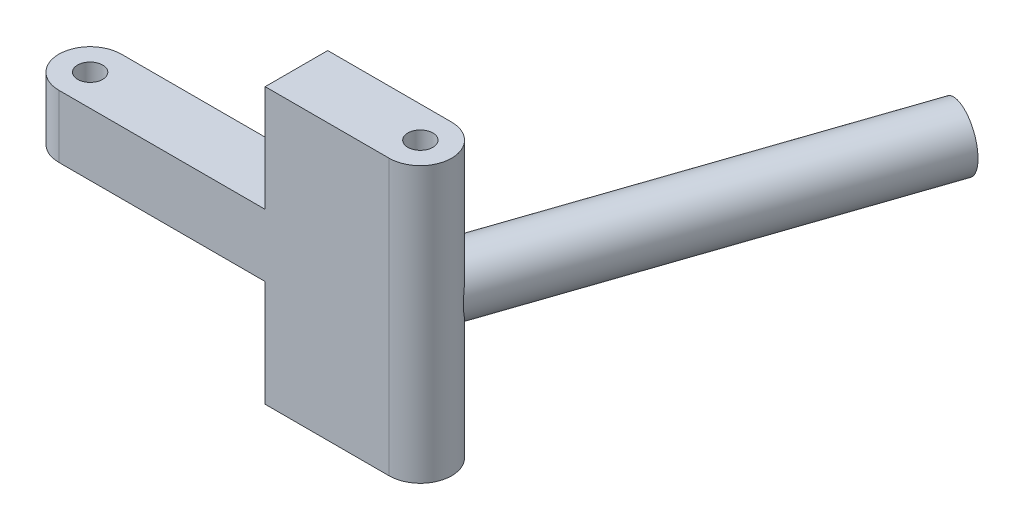
ISO-10303-21;
HEADER;
FILE_DESCRIPTION(('STEP AP214'),'2;1');
FILE_NAME('part.step','',(''),(''),'','','');
FILE_SCHEMA(('AUTOMOTIVE_DESIGN { 1 0 10303 214 1 1 1 1 }'));
ENDSEC;
DATA;
#1=APPLICATION_CONTEXT('core data for automotive mechanical design processes');
#2=APPLICATION_PROTOCOL_DEFINITION('international standard','automotive_design',2000,#1);
#3=PRODUCT_CONTEXT('',#1,'mechanical');
#4=PRODUCT('Part','Part','',(#3));
#5=PRODUCT_RELATED_PRODUCT_CATEGORY('part','',(#4));
#6=PRODUCT_DEFINITION_FORMATION('','',#4);
#7=PRODUCT_DEFINITION_CONTEXT('part definition',#1,'design');
#8=PRODUCT_DEFINITION('design','',#6,#7);
#9=PRODUCT_DEFINITION_SHAPE('','',#8);
#10=(LENGTH_UNIT() NAMED_UNIT(*) SI_UNIT(.MILLI.,.METRE.));
#11=(NAMED_UNIT(*) PLANE_ANGLE_UNIT() SI_UNIT($,.RADIAN.));
#12=(NAMED_UNIT(*) SI_UNIT($,.STERADIAN.) SOLID_ANGLE_UNIT());
#13=UNCERTAINTY_MEASURE_WITH_UNIT(LENGTH_MEASURE(1.E-05),#10,'distance_accuracy_value','');
#14=(GEOMETRIC_REPRESENTATION_CONTEXT(3) GLOBAL_UNCERTAINTY_ASSIGNED_CONTEXT((#13)) GLOBAL_UNIT_ASSIGNED_CONTEXT((#10,
#11,#12)) REPRESENTATION_CONTEXT('',''));
#15=CARTESIAN_POINT('',(0.,0.,0.));
#16=DIRECTION('',(0.,0.,1.));
#17=DIRECTION('',(1.,0.,0.));
#18=AXIS2_PLACEMENT_3D('',#15,#16,#17);
#19=CARTESIAN_POINT('',(0.,22.,-2.5));
#20=DIRECTION('',(0.,0.,1.));
#21=DIRECTION('',(1.,0.,0.));
#22=AXIS2_PLACEMENT_3D('',#19,#20,#21);
#23=PLANE('',#22);
#24=CARTESIAN_POINT('',(26.4099999999985,11.,-2.49999999994088));
#25=DIRECTION('',(0.,0.,1.));
#26=DIRECTION('',(1.,0.,0.));
#27=AXIS2_PLACEMENT_3D('',#24,#25,#26);
#28=ELLIPSE('',#27,2.53480640832575,2.4);
#29=CARTESIAN_POINT('',(26.41,8.6,-2.5));
#30=VERTEX_POINT('',#29);
#31=CARTESIAN_POINT('',(26.41,13.4,-2.5));
#32=VERTEX_POINT('',#31);
#33=EDGE_CURVE('E120',#30,#32,#28,.F.);
#34=ORIENTED_EDGE('',*,*,#33,.F.);
#35=DIRECTION('',(0.,-1.,0.));
#36=VECTOR('',#35,1.);
#37=CARTESIAN_POINT('',(26.41,22.,-2.5));
#38=LINE('',#37,#36);
#39=CARTESIAN_POINT('',(26.41,0.,-2.5));
#40=VERTEX_POINT('',#39);
#41=EDGE_CURVE('E107',#30,#40,#38,.T.);
#42=ORIENTED_EDGE('',*,*,#41,.T.);
#43=DIRECTION('',(-1.,0.,0.));
#44=VECTOR('',#43,1.);
#45=CARTESIAN_POINT('',(0.,0.,-2.5));
#46=LINE('',#45,#44);
#47=CARTESIAN_POINT('',(16.5,0.,-2.5));
#48=VERTEX_POINT('',#47);
#49=EDGE_CURVE('E210',#40,#48,#46,.T.);
#50=ORIENTED_EDGE('',*,*,#49,.T.);
#51=DIRECTION('',(0.,1.,0.));
#52=VECTOR('',#51,1.);
#53=CARTESIAN_POINT('',(16.5,0.,-2.5));
#54=LINE('',#53,#52);
#55=CARTESIAN_POINT('',(16.5,8.5,-2.5));
#56=VERTEX_POINT('',#55);
#57=EDGE_CURVE('E59',#48,#56,#54,.T.);
#58=ORIENTED_EDGE('',*,*,#57,.T.);
#59=DIRECTION('',(-1.,0.,0.));
#60=VECTOR('',#59,1.);
#61=CARTESIAN_POINT('',(16.5,8.5,-2.5));
#62=LINE('',#61,#60);
#63=CARTESIAN_POINT('',(0.,8.5,-2.5));
#64=VERTEX_POINT('',#63);
#65=EDGE_CURVE('E171',#56,#64,#62,.T.);
#66=ORIENTED_EDGE('',*,*,#65,.T.);
#67=DIRECTION('',(0.,-1.,0.));
#68=VECTOR('',#67,1.);
#69=CARTESIAN_POINT('',(0.,22.,-2.5));
#70=LINE('',#69,#68);
#71=CARTESIAN_POINT('',(0.,13.5,-2.5));
#72=VERTEX_POINT('',#71);
#73=EDGE_CURVE('E117',#72,#64,#70,.T.);
#74=ORIENTED_EDGE('',*,*,#73,.F.);
#75=DIRECTION('',(-1.,0.,0.));
#76=VECTOR('',#75,1.);
#77=CARTESIAN_POINT('',(16.5,13.5,-2.5));
#78=LINE('',#77,#76);
#79=CARTESIAN_POINT('',(16.5,13.5,-2.5));
#80=VERTEX_POINT('',#79);
#81=EDGE_CURVE('E193',#80,#72,#78,.T.);
#82=ORIENTED_EDGE('',*,*,#81,.F.);
#83=DIRECTION('',(0.,1.,0.));
#84=VECTOR('',#83,1.);
#85=CARTESIAN_POINT('',(16.5,13.5,-2.5));
#86=LINE('',#85,#84);
#87=CARTESIAN_POINT('',(16.5,22.,-2.5));
#88=VERTEX_POINT('',#87);
#89=EDGE_CURVE('E182',#80,#88,#86,.T.);
#90=ORIENTED_EDGE('',*,*,#89,.T.);
#91=DIRECTION('',(-1.,0.,0.));
#92=VECTOR('',#91,1.);
#93=CARTESIAN_POINT('',(0.,22.,-2.5));
#94=LINE('',#93,#92);
#95=CARTESIAN_POINT('',(26.41,22.,-2.5));
#96=VERTEX_POINT('',#95);
#97=EDGE_CURVE('E212',#96,#88,#94,.T.);
#98=ORIENTED_EDGE('',*,*,#97,.F.);
#99=EDGE_CURVE('E116',#96,#32,#38,.T.);
#100=ORIENTED_EDGE('',*,*,#99,.T.);
#101=EDGE_LOOP('',(#34,#42,#50,#58,#66,#74,#82,#90,#98,#100));
#102=FACE_BOUND('',#101,.T.);
#103=ADVANCED_FACE('F32',(#102),#23,.F.);
#104=CARTESIAN_POINT('',(26.41,22.,0.));
#105=DIRECTION('',(0.,-1.,0.));
#106=DIRECTION('',(0.,0.,-1.));
#107=AXIS2_PLACEMENT_3D('',#104,#105,#106);
#108=CYLINDRICAL_SURFACE('',#107,2.5);
#109=CARTESIAN_POINT('',(26.41,13.4,-2.5));
#110=CARTESIAN_POINT('',(26.4615946304156,13.4000099723578,-2.50001071807093));
#111=CARTESIAN_POINT('',(26.5131945782806,13.3985087895232,-2.49840303003674));
#112=CARTESIAN_POINT('',(26.6160104973246,13.3923657206669,-2.49202703369465));
#113=CARTESIAN_POINT('',(26.6672264641005,13.3877237986866,-2.48725868920014));
#114=CARTESIAN_POINT('',(26.7686437226568,13.3752098360181,-2.47466673867398));
#115=CARTESIAN_POINT('',(26.818848609815,13.3673528221119,-2.46685735404089));
#116=CARTESIAN_POINT('',(26.9180783028735,13.3483840734609,-2.44834813872412));
#117=CARTESIAN_POINT('',(26.9671032051848,13.3372726056061,-2.43764854506526));
#118=CARTESIAN_POINT('',(27.1119394009845,13.2990440664266,-2.40148890390445));
#119=CARTESIAN_POINT('',(27.2055226289187,13.2670315928399,-2.37196664367158));
#120=CARTESIAN_POINT('',(27.3841855070412,13.1908310480464,-2.30437093590649));
#121=CARTESIAN_POINT('',(27.4692600863269,13.1466357744873,-2.2662924324763));
#122=CARTESIAN_POINT('',(27.6309616555491,13.0465873419139,-2.18349308115402));
#123=CARTESIAN_POINT('',(27.7074210898089,12.9905493447005,-2.13867062009907));
#124=CARTESIAN_POINT('',(27.8497245787005,12.8687701826741,-2.04558960159304));
#125=CARTESIAN_POINT('',(27.915564434483,12.8030251994222,-1.997329695838));
#126=CARTESIAN_POINT('',(28.0479459985044,12.6501490566726,-1.89092774874696));
#127=CARTESIAN_POINT('',(28.1123711334293,12.5613107177295,-1.83260686639321));
#128=CARTESIAN_POINT('',(28.2272285419139,12.3731597966721,-1.71878978603978));
#129=CARTESIAN_POINT('',(28.2776336143551,12.273827362254,-1.66329924726677));
#130=CARTESIAN_POINT('',(28.3725858629816,12.0478590121505,-1.55066220647221));
#131=CARTESIAN_POINT('',(28.4146297657153,11.9194668931051,-1.49487591707525));
#132=CARTESIAN_POINT('',(28.48081833517,11.6519317505917,-1.40179843978112));
#133=CARTESIAN_POINT('',(28.5050187924912,11.5128237518647,-1.3644497257163));
#134=CARTESIAN_POINT('',(28.5315141509342,11.2663967885168,-1.32272632301872));
#135=CARTESIAN_POINT('',(28.5379452816594,11.1605674818318,-1.31219174415476));
#136=CARTESIAN_POINT('',(28.5412177373729,10.9483858262708,-1.30687877128288));
#137=CARTESIAN_POINT('',(28.5380642872741,10.842033793912,-1.31209179266063));
#138=CARTESIAN_POINT('',(28.5222441874212,10.6322534802404,-1.33739573522226));
#139=CARTESIAN_POINT('',(28.5096070843083,10.5288171513056,-1.35744044506368));
#140=CARTESIAN_POINT('',(28.4749325950546,10.3266693412147,-1.40961742283439));
#141=CARTESIAN_POINT('',(28.4528852350154,10.227962997171,-1.44176251163291));
#142=CARTESIAN_POINT('',(28.3963691778768,10.026012898347,-1.51883405394607));
#143=CARTESIAN_POINT('',(28.3607973486271,9.92347248128588,-1.56478018185537));
#144=CARTESIAN_POINT('',(28.277580409847,9.72669330002573,-1.66322094937982));
#145=CARTESIAN_POINT('',(28.2299215252055,9.6324641741152,-1.71572302564415));
#146=CARTESIAN_POINT('',(28.1098781299682,9.43326839515506,-1.83551617603495));
#147=CARTESIAN_POINT('',(28.0343512702602,9.33058032621386,-1.90349786428358));
#148=CARTESIAN_POINT('',(27.8633221204562,9.14157977790691,-2.03705116244829));
#149=CARTESIAN_POINT('',(27.7678516139595,9.05524165456281,-2.10262641425716));
#150=CARTESIAN_POINT('',(27.5843004491627,8.92206552912586,-2.20889070887606));
#151=CARTESIAN_POINT('',(27.5006404538076,8.87078020382044,-2.25164133423013));
#152=CARTESIAN_POINT('',(27.3234136413188,8.78071228905231,-2.32916287638044));
#153=CARTESIAN_POINT('',(27.2298523635477,8.74192275731701,-2.36393822088889));
#154=CARTESIAN_POINT('',(27.0344228651539,8.67792752318724,-2.42292603123823));
#155=CARTESIAN_POINT('',(26.9325120004979,8.65279729359972,-2.44707967087139));
#156=CARTESIAN_POINT('',(26.7241170843924,8.61686734961208,-2.4824286134934));
#157=CARTESIAN_POINT('',(26.6176417612673,8.6060414424184,-2.49364759645083));
#158=CARTESIAN_POINT('',(26.4940458353191,8.60127891683171,-2.49864439458979));
#159=CARTESIAN_POINT('',(26.4772319405941,8.6007975376964,-2.49915290716315));
#160=CARTESIAN_POINT('',(26.4436137600939,8.60015875625429,-2.49983000453807));
#161=CARTESIAN_POINT('',(26.4268094918339,8.60000091886578,-2.49999904583628));
#162=CARTESIAN_POINT('',(26.41,8.6,-2.5));
#163=B_SPLINE_CURVE_WITH_KNOTS('',3,(#109,#110,#111,#112,#113,#114,#115,#116,#117,#118,#119,
#120,#121,#122,#123,#124,#125,#126,#127,#128,#129,#130,#131,#132,#133,#134,#135,#136,#137,#138,
#139,#140,#141,#142,#143,#144,#145,#146,#147,#148,#149,#150,#151,#152,#153,#154,#155,#156,#157,
#158,#159,#160,#161,#162),.UNSPECIFIED.,.F.,.F.,(4,2,2,2,2,2,2,2,2,2,2,2,2,2,2,2,2,2,2,2,2,2,2,
2,2,2,4),(0.,0.154743555358741,0.309488882419,0.463519070735018,0.617536630933354,
0.925540362151689,1.23372657413292,1.54713455415197,1.86066614962681,2.23210887186681,
2.60426730275608,3.04050965490153,3.47538216808782,3.79352785362205,4.1115001371767,
4.42848585882657,4.74580839010489,5.0981857376431,5.45096649379481,5.88227209645313,
6.31289551349915,6.63270292411462,6.95233235207057,7.27371035020193,7.59449905042827,
7.64498334505437,7.69539970643755),.UNSPECIFIED.);
#164=EDGE_CURVE('E11',#32,#30,#163,.T.);
#165=ORIENTED_EDGE('',*,*,#164,.F.);
#166=ORIENTED_EDGE('',*,*,#99,.F.);
#167=CARTESIAN_POINT('',(26.41,22.,0.));
#168=DIRECTION('',(0.,1.,0.));
#169=DIRECTION('',(0.,0.,1.));
#170=AXIS2_PLACEMENT_3D('',#167,#168,#169);
#171=CIRCLE('',#170,2.5);
#172=CARTESIAN_POINT('',(26.41,22.,2.5));
#173=VERTEX_POINT('',#172);
#174=EDGE_CURVE('E209',#173,#96,#171,.T.);
#175=ORIENTED_EDGE('',*,*,#174,.F.);
#176=DIRECTION('',(0.,-1.,0.));
#177=VECTOR('',#176,1.);
#178=CARTESIAN_POINT('',(26.41,22.,2.5));
#179=LINE('',#178,#177);
#180=CARTESIAN_POINT('',(26.41,0.,2.5));
#181=VERTEX_POINT('',#180);
#182=EDGE_CURVE('E222',#173,#181,#179,.T.);
#183=ORIENTED_EDGE('',*,*,#182,.T.);
#184=CARTESIAN_POINT('',(26.41,0.,0.));
#185=DIRECTION('',(0.,1.,0.));
#186=DIRECTION('',(0.,0.,1.));
#187=AXIS2_PLACEMENT_3D('',#184,#185,#186);
#188=CIRCLE('',#187,2.5);
#189=EDGE_CURVE('E112',#181,#40,#188,.T.);
#190=ORIENTED_EDGE('',*,*,#189,.T.);
#191=ORIENTED_EDGE('',*,*,#41,.F.);
#192=EDGE_LOOP('',(#165,#166,#175,#183,#190,#191));
#193=FACE_BOUND('',#192,.T.);
#194=ADVANCED_FACE('F109',(#193),#108,.T.);
#195=CARTESIAN_POINT('',(0.,22.,0.));
#196=DIRECTION('',(0.,-1.,0.));
#197=DIRECTION('',(0.,0.,-1.));
#198=AXIS2_PLACEMENT_3D('',#195,#196,#197);
#199=CYLINDRICAL_SURFACE('',#198,2.5);
#200=CARTESIAN_POINT('',(0.,8.5,0.));
#201=DIRECTION('',(0.,-1.,0.));
#202=DIRECTION('',(0.,0.,-1.));
#203=AXIS2_PLACEMENT_3D('',#200,#201,#202);
#204=CIRCLE('',#203,2.5);
#205=CARTESIAN_POINT('',(0.,8.5,2.5));
#206=VERTEX_POINT('',#205);
#207=EDGE_CURVE('E180',#206,#64,#204,.T.);
#208=ORIENTED_EDGE('',*,*,#207,.F.);
#209=DIRECTION('',(0.,-1.,0.));
#210=VECTOR('',#209,1.);
#211=CARTESIAN_POINT('',(0.,22.,2.5));
#212=LINE('',#211,#210);
#213=CARTESIAN_POINT('',(0.,13.5,2.5));
#214=VERTEX_POINT('',#213);
#215=EDGE_CURVE('E46',#214,#206,#212,.T.);
#216=ORIENTED_EDGE('',*,*,#215,.F.);
#217=CARTESIAN_POINT('',(0.,13.5,0.));
#218=DIRECTION('',(0.,1.,0.));
#219=DIRECTION('',(0.,0.,1.));
#220=AXIS2_PLACEMENT_3D('',#217,#218,#219);
#221=CIRCLE('',#220,2.5);
#222=EDGE_CURVE('E198',#72,#214,#221,.T.);
#223=ORIENTED_EDGE('',*,*,#222,.F.);
#224=ORIENTED_EDGE('',*,*,#73,.T.);
#225=EDGE_LOOP('',(#208,#216,#223,#224));
#226=FACE_BOUND('',#225,.T.);
#227=ADVANCED_FACE('F34',(#226),#199,.T.);
#228=CARTESIAN_POINT('',(0.,22.,2.5));
#229=DIRECTION('',(0.,0.,-1.));
#230=DIRECTION('',(-1.,0.,0.));
#231=AXIS2_PLACEMENT_3D('',#228,#229,#230);
#232=PLANE('',#231);
#233=DIRECTION('',(-1.,0.,0.));
#234=VECTOR('',#233,1.);
#235=CARTESIAN_POINT('',(16.5,8.5,2.5));
#236=LINE('',#235,#234);
#237=CARTESIAN_POINT('',(16.5,8.5,2.5));
#238=VERTEX_POINT('',#237);
#239=EDGE_CURVE('E163',#238,#206,#236,.T.);
#240=ORIENTED_EDGE('',*,*,#239,.F.);
#241=DIRECTION('',(0.,-1.,0.));
#242=VECTOR('',#241,1.);
#243=CARTESIAN_POINT('',(16.5,0.,2.5));
#244=LINE('',#243,#242);
#245=CARTESIAN_POINT('',(16.5,0.,2.5));
#246=VERTEX_POINT('',#245);
#247=EDGE_CURVE('E165',#238,#246,#244,.T.);
#248=ORIENTED_EDGE('',*,*,#247,.T.);
#249=DIRECTION('',(1.,0.,0.));
#250=VECTOR('',#249,1.);
#251=CARTESIAN_POINT('',(0.,0.,2.5));
#252=LINE('',#251,#250);
#253=EDGE_CURVE('E204',#246,#181,#252,.T.);
#254=ORIENTED_EDGE('',*,*,#253,.T.);
#255=ORIENTED_EDGE('',*,*,#182,.F.);
#256=DIRECTION('',(1.,0.,0.));
#257=VECTOR('',#256,1.);
#258=CARTESIAN_POINT('',(0.,22.,2.5));
#259=LINE('',#258,#257);
#260=CARTESIAN_POINT('',(16.5,22.,2.5));
#261=VERTEX_POINT('',#260);
#262=EDGE_CURVE('E207',#261,#173,#259,.T.);
#263=ORIENTED_EDGE('',*,*,#262,.F.);
#264=DIRECTION('',(0.,-1.,0.));
#265=VECTOR('',#264,1.);
#266=CARTESIAN_POINT('',(16.5,13.5,2.5));
#267=LINE('',#266,#265);
#268=CARTESIAN_POINT('',(16.5,13.5,2.5));
#269=VERTEX_POINT('',#268);
#270=EDGE_CURVE('E188',#261,#269,#267,.T.);
#271=ORIENTED_EDGE('',*,*,#270,.T.);
#272=DIRECTION('',(-1.,0.,0.));
#273=VECTOR('',#272,1.);
#274=CARTESIAN_POINT('',(16.5,13.5,2.5));
#275=LINE('',#274,#273);
#276=EDGE_CURVE('E195',#269,#214,#275,.T.);
#277=ORIENTED_EDGE('',*,*,#276,.T.);
#278=ORIENTED_EDGE('',*,*,#215,.T.);
#279=EDGE_LOOP('',(#240,#248,#254,#255,#263,#271,#277,#278));
#280=FACE_BOUND('',#279,.T.);
#281=ADVANCED_FACE('F149',(#280),#232,.F.);
#282=CARTESIAN_POINT('',(0.,0.,0.));
#283=DIRECTION('',(0.,1.,0.));
#284=DIRECTION('',(0.,0.,1.));
#285=AXIS2_PLACEMENT_3D('',#282,#283,#284);
#286=CYLINDRICAL_SURFACE('',#285,1.);
#287=CARTESIAN_POINT('',(0.,13.5,0.));
#288=DIRECTION('',(0.,1.,0.));
#289=DIRECTION('',(0.,0.,1.));
#290=AXIS2_PLACEMENT_3D('',#287,#288,#289);
#291=CIRCLE('',#290,1.);
#292=CARTESIAN_POINT('',(0.,13.5,1.));
#293=VERTEX_POINT('',#292);
#294=EDGE_CURVE('E197',#293,#293,#291,.F.);
#295=ORIENTED_EDGE('',*,*,#294,.F.);
#296=EDGE_LOOP('',(#295));
#297=FACE_BOUND('',#296,.T.);
#298=CARTESIAN_POINT('',(0.,8.5,0.));
#299=DIRECTION('',(0.,-1.,0.));
#300=DIRECTION('',(0.,0.,-1.));
#301=AXIS2_PLACEMENT_3D('',#298,#299,#300);
#302=CIRCLE('',#301,1.);
#303=CARTESIAN_POINT('',(0.,8.5,-1.));
#304=VERTEX_POINT('',#303);
#305=EDGE_CURVE('E175',#304,#304,#302,.F.);
#306=ORIENTED_EDGE('',*,*,#305,.F.);
#307=EDGE_LOOP('',(#306));
#308=FACE_BOUND('',#307,.T.);
#309=ADVANCED_FACE('F151',(#297,#308),#286,.F.);
#310=CARTESIAN_POINT('',(0.,0.,0.));
#311=DIRECTION('',(0.,1.,0.));
#312=DIRECTION('',(0.,0.,1.));
#313=AXIS2_PLACEMENT_3D('',#310,#311,#312);
#314=PLANE('',#313);
#315=CARTESIAN_POINT('',(26.41,0.,0.));
#316=DIRECTION('',(0.,1.,0.));
#317=DIRECTION('',(0.,0.,1.));
#318=AXIS2_PLACEMENT_3D('',#315,#316,#317);
#319=CIRCLE('',#318,0.999999999999998);
#320=CARTESIAN_POINT('',(26.41,0.,0.999999999999998));
#321=VERTEX_POINT('',#320);
#322=EDGE_CURVE('E201',#321,#321,#319,.T.);
#323=ORIENTED_EDGE('',*,*,#322,.T.);
#324=EDGE_LOOP('',(#323));
#325=FACE_BOUND('',#324,.T.);
#326=DIRECTION('',(0.,0.,-1.));
#327=VECTOR('',#326,1.);
#328=CARTESIAN_POINT('',(16.5,0.,2.5));
#329=LINE('',#328,#327);
#330=EDGE_CURVE('E234',#246,#48,#329,.T.);
#331=ORIENTED_EDGE('',*,*,#330,.T.);
#332=ORIENTED_EDGE('',*,*,#49,.F.);
#333=ORIENTED_EDGE('',*,*,#189,.F.);
#334=ORIENTED_EDGE('',*,*,#253,.F.);
#335=EDGE_LOOP('',(#331,#332,#333,#334));
#336=FACE_BOUND('',#335,.T.);
#337=ADVANCED_FACE('F146',(#325,#336),#314,.F.);
#338=CARTESIAN_POINT('',(0.,22.,0.));
#339=DIRECTION('',(0.,1.,0.));
#340=DIRECTION('',(0.,0.,1.));
#341=AXIS2_PLACEMENT_3D('',#338,#339,#340);
#342=PLANE('',#341);
#343=DIRECTION('',(0.,0.,1.));
#344=VECTOR('',#343,1.);
#345=CARTESIAN_POINT('',(16.5,22.,-2.5));
#346=LINE('',#345,#344);
#347=EDGE_CURVE('E185',#88,#261,#346,.T.);
#348=ORIENTED_EDGE('',*,*,#347,.T.);
#349=ORIENTED_EDGE('',*,*,#262,.T.);
#350=ORIENTED_EDGE('',*,*,#174,.T.);
#351=ORIENTED_EDGE('',*,*,#97,.T.);
#352=EDGE_LOOP('',(#348,#349,#350,#351));
#353=FACE_BOUND('',#352,.T.);
#354=CARTESIAN_POINT('',(26.41,22.,0.));
#355=DIRECTION('',(0.,1.,0.));
#356=DIRECTION('',(0.,0.,1.));
#357=AXIS2_PLACEMENT_3D('',#354,#355,#356);
#358=CIRCLE('',#357,0.999999999999998);
#359=CARTESIAN_POINT('',(26.41,22.,0.999999999999998));
#360=VERTEX_POINT('',#359);
#361=EDGE_CURVE('E200',#360,#360,#358,.T.);
#362=ORIENTED_EDGE('',*,*,#361,.F.);
#363=EDGE_LOOP('',(#362));
#364=FACE_BOUND('',#363,.T.);
#365=ADVANCED_FACE('F251',(#353,#364),#342,.T.);
#366=CARTESIAN_POINT('',(26.41,0.,0.));
#367=DIRECTION('',(0.,1.,0.));
#368=DIRECTION('',(0.,0.,1.));
#369=AXIS2_PLACEMENT_3D('',#366,#367,#368);
#370=CYLINDRICAL_SURFACE('',#369,0.999999999999998);
#371=ORIENTED_EDGE('',*,*,#322,.F.);
#372=EDGE_LOOP('',(#371));
#373=FACE_BOUND('',#372,.T.);
#374=ORIENTED_EDGE('',*,*,#361,.T.);
#375=EDGE_LOOP('',(#374));
#376=FACE_BOUND('',#375,.T.);
#377=ADVANCED_FACE('F254',(#373,#376),#370,.F.);
#378=CARTESIAN_POINT('',(16.5,13.5,-2.5));
#379=DIRECTION('',(0.,1.,0.));
#380=DIRECTION('',(0.,0.,1.));
#381=AXIS2_PLACEMENT_3D('',#378,#379,#380);
#382=PLANE('',#381);
#383=ORIENTED_EDGE('',*,*,#294,.T.);
#384=EDGE_LOOP('',(#383));
#385=FACE_BOUND('',#384,.T.);
#386=ORIENTED_EDGE('',*,*,#222,.T.);
#387=ORIENTED_EDGE('',*,*,#276,.F.);
#388=DIRECTION('',(0.,0.,-1.));
#389=VECTOR('',#388,1.);
#390=CARTESIAN_POINT('',(16.5,13.5,-2.5));
#391=LINE('',#390,#389);
#392=EDGE_CURVE('E191',#269,#80,#391,.T.);
#393=ORIENTED_EDGE('',*,*,#392,.T.);
#394=ORIENTED_EDGE('',*,*,#81,.T.);
#395=EDGE_LOOP('',(#386,#387,#393,#394));
#396=FACE_BOUND('',#395,.T.);
#397=ADVANCED_FACE('F245',(#385,#396),#382,.T.);
#398=CARTESIAN_POINT('',(16.5,0.,0.));
#399=DIRECTION('',(1.,0.,0.));
#400=DIRECTION('',(0.,0.,-1.));
#401=AXIS2_PLACEMENT_3D('',#398,#399,#400);
#402=PLANE('',#401);
#403=ORIENTED_EDGE('',*,*,#89,.F.);
#404=ORIENTED_EDGE('',*,*,#392,.F.);
#405=ORIENTED_EDGE('',*,*,#270,.F.);
#406=ORIENTED_EDGE('',*,*,#347,.F.);
#407=EDGE_LOOP('',(#403,#404,#405,#406));
#408=FACE_BOUND('',#407,.T.);
#409=ADVANCED_FACE('F249',(#408),#402,.F.);
#410=CARTESIAN_POINT('',(16.5,8.5,2.5));
#411=DIRECTION('',(0.,-1.,0.));
#412=DIRECTION('',(0.,0.,-1.));
#413=AXIS2_PLACEMENT_3D('',#410,#411,#412);
#414=PLANE('',#413);
#415=ORIENTED_EDGE('',*,*,#305,.T.);
#416=EDGE_LOOP('',(#415));
#417=FACE_BOUND('',#416,.T.);
#418=ORIENTED_EDGE('',*,*,#207,.T.);
#419=ORIENTED_EDGE('',*,*,#65,.F.);
#420=DIRECTION('',(0.,0.,1.));
#421=VECTOR('',#420,1.);
#422=CARTESIAN_POINT('',(16.5,8.5,2.5));
#423=LINE('',#422,#421);
#424=EDGE_CURVE('E172',#56,#238,#423,.T.);
#425=ORIENTED_EDGE('',*,*,#424,.T.);
#426=ORIENTED_EDGE('',*,*,#239,.T.);
#427=EDGE_LOOP('',(#418,#419,#425,#426));
#428=FACE_BOUND('',#427,.T.);
#429=ADVANCED_FACE('F136',(#417,#428),#414,.T.);
#430=CARTESIAN_POINT('',(16.5,0.,0.));
#431=DIRECTION('',(-1.,0.,0.));
#432=DIRECTION('',(0.,0.,1.));
#433=AXIS2_PLACEMENT_3D('',#430,#431,#432);
#434=PLANE('',#433);
#435=ORIENTED_EDGE('',*,*,#247,.F.);
#436=ORIENTED_EDGE('',*,*,#424,.F.);
#437=ORIENTED_EDGE('',*,*,#57,.F.);
#438=ORIENTED_EDGE('',*,*,#330,.F.);
#439=EDGE_LOOP('',(#435,#436,#437,#438));
#440=FACE_BOUND('',#439,.T.);
#441=ADVANCED_FACE('F128',(#440),#434,.T.);
#442=CARTESIAN_POINT('',(36.706639573893,11.,-32.7981717845374));
#443=DIRECTION('',(-0.321769986684158,0.,0.946817868266794));
#444=DIRECTION('',(0.946817868266795,0.,0.321769986684158));
#445=AXIS2_PLACEMENT_3D('',#442,#443,#444);
#446=CYLINDRICAL_SURFACE('',#445,2.4);
#447=CARTESIAN_POINT('',(36.706639573893,11.,-32.7981717845374));
#448=DIRECTION('',(0.321769986684158,0.,-0.946817868266795));
#449=DIRECTION('',(-0.946817868266794,0.,-0.321769986684158));
#450=AXIS2_PLACEMENT_3D('',#447,#448,#449);
#451=CIRCLE('',#450,2.4);
#452=CARTESIAN_POINT('',(34.4342766900527,11.,-33.5704197525794));
#453=VERTEX_POINT('',#452);
#454=EDGE_CURVE('E123',#453,#453,#451,.T.);
#455=ORIENTED_EDGE('',*,*,#454,.F.);
#456=EDGE_LOOP('',(#455));
#457=FACE_BOUND('',#456,.T.);
#458=ORIENTED_EDGE('',*,*,#33,.T.);
#459=ORIENTED_EDGE('',*,*,#164,.T.);
#460=EDGE_LOOP('',(#458,#459));
#461=FACE_BOUND('',#460,.T.);
#462=ADVANCED_FACE('F125',(#457,#461),#446,.T.);
#463=CARTESIAN_POINT('',(36.706639573893,11.,-32.7981717845374));
#464=DIRECTION('',(0.321769986684158,0.,-0.946817868266795));
#465=DIRECTION('',(-0.946817868266794,0.,-0.321769986684158));
#466=AXIS2_PLACEMENT_3D('',#463,#464,#465);
#467=PLANE('',#466);
#468=ORIENTED_EDGE('',*,*,#454,.T.);
#469=EDGE_LOOP('',(#468));
#470=FACE_BOUND('',#469,.T.);
#471=ADVANCED_FACE('F127',(#470),#467,.T.);
#472=CLOSED_SHELL('',(#103,#194,#227,#281,#309,#337,#365,#377,#397,#409,#429,#441,#462,#471));
#473=MANIFOLD_SOLID_BREP('B2',#472);
#474=ADVANCED_BREP_SHAPE_REPRESENTATION('',(#18,#473),#14);
#475=SHAPE_DEFINITION_REPRESENTATION(#9,#474);
ENDSEC;
END-ISO-10303-21;
